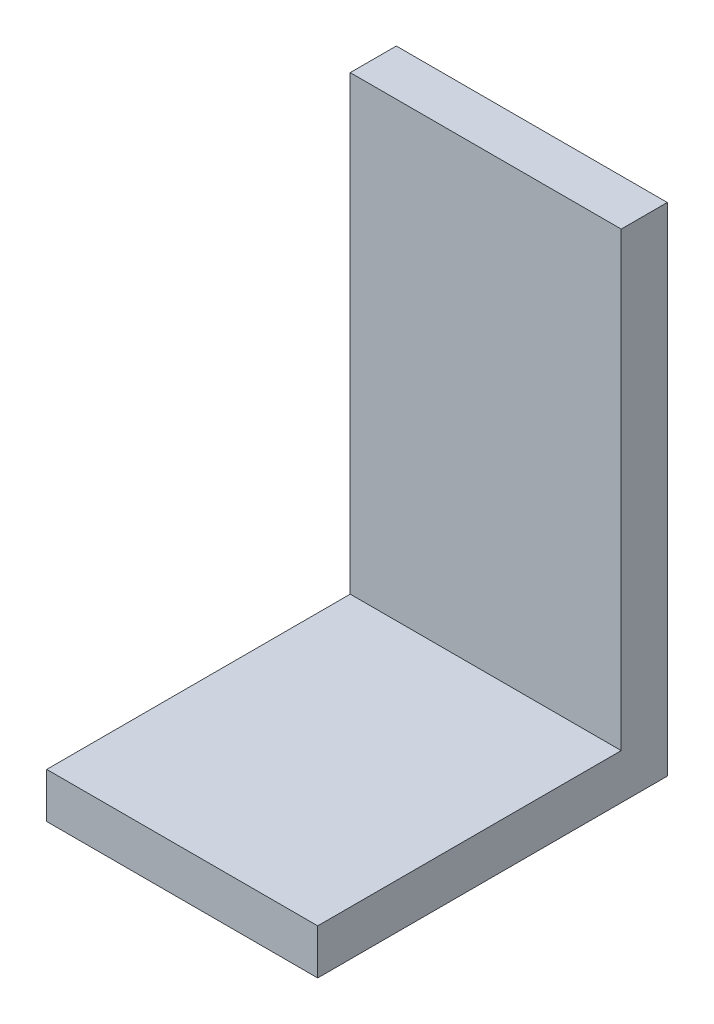
ISO-10303-21;
HEADER;
FILE_DESCRIPTION(('STEP AP214'),'2;1');
FILE_NAME('part.step','',(''),(''),'','','');
FILE_SCHEMA(('AUTOMOTIVE_DESIGN { 1 0 10303 214 1 1 1 1 }'));
ENDSEC;
DATA;
#1=APPLICATION_CONTEXT('core data for automotive mechanical design processes');
#2=APPLICATION_PROTOCOL_DEFINITION('international standard','automotive_design',2000,#1);
#3=PRODUCT_CONTEXT('',#1,'mechanical');
#4=PRODUCT('Part','Part','',(#3));
#5=PRODUCT_RELATED_PRODUCT_CATEGORY('part','',(#4));
#6=PRODUCT_DEFINITION_FORMATION('','',#4);
#7=PRODUCT_DEFINITION_CONTEXT('part definition',#1,'design');
#8=PRODUCT_DEFINITION('design','',#6,#7);
#9=PRODUCT_DEFINITION_SHAPE('','',#8);
#10=(LENGTH_UNIT() NAMED_UNIT(*) SI_UNIT(.MILLI.,.METRE.));
#11=(NAMED_UNIT(*) PLANE_ANGLE_UNIT() SI_UNIT($,.RADIAN.));
#12=(NAMED_UNIT(*) SI_UNIT($,.STERADIAN.) SOLID_ANGLE_UNIT());
#13=UNCERTAINTY_MEASURE_WITH_UNIT(LENGTH_MEASURE(1.E-05),#10,'distance_accuracy_value','');
#14=(GEOMETRIC_REPRESENTATION_CONTEXT(3) GLOBAL_UNCERTAINTY_ASSIGNED_CONTEXT((#13)) GLOBAL_UNIT_ASSIGNED_CONTEXT((#10,
#11,#12)) REPRESENTATION_CONTEXT('',''));
#15=CARTESIAN_POINT('',(0.,0.,0.));
#16=DIRECTION('',(0.,0.,1.));
#17=DIRECTION('',(1.,0.,0.));
#18=AXIS2_PLACEMENT_3D('',#15,#16,#17);
#19=CARTESIAN_POINT('',(-3.1,-4.55,0.));
#20=DIRECTION('',(1.,0.,0.));
#21=DIRECTION('',(0.,0.,1.));
#22=AXIS2_PLACEMENT_3D('',#19,#20,#21);
#23=PLANE('',#22);
#24=DIRECTION('',(0.,-1.,0.));
#25=VECTOR('',#24,1.);
#26=CARTESIAN_POINT('',(-3.1,-4.,0.));
#27=LINE('',#26,#25);
#28=CARTESIAN_POINT('',(-3.1,-4.,0.));
#29=VERTEX_POINT('',#28);
#30=CARTESIAN_POINT('',(-3.1,-4.55,0.));
#31=VERTEX_POINT('',#30);
#32=EDGE_CURVE('E11',#29,#31,#27,.T.);
#33=ORIENTED_EDGE('',*,*,#32,.F.);
#34=DIRECTION('',(0.,0.,-1.));
#35=VECTOR('',#34,1.);
#36=CARTESIAN_POINT('',(-3.1,-4.,0.051));
#37=LINE('',#36,#35);
#38=CARTESIAN_POINT('',(-3.1,-4.,0.051));
#39=VERTEX_POINT('',#38);
#40=EDGE_CURVE('E24',#39,#29,#37,.T.);
#41=ORIENTED_EDGE('',*,*,#40,.F.);
#42=DIRECTION('',(0.,1.,0.));
#43=VECTOR('',#42,1.);
#44=CARTESIAN_POINT('',(-3.1,-4.5,0.051));
#45=LINE('',#44,#43);
#46=CARTESIAN_POINT('',(-3.1,-4.5,0.051));
#47=VERTEX_POINT('',#46);
#48=EDGE_CURVE('E87',#47,#39,#45,.T.);
#49=ORIENTED_EDGE('',*,*,#48,.F.);
#50=DIRECTION('',(0.,0.,-1.));
#51=VECTOR('',#50,1.);
#52=CARTESIAN_POINT('',(-3.1,-4.5,0.387));
#53=LINE('',#52,#51);
#54=CARTESIAN_POINT('',(-3.1,-4.5,0.387));
#55=VERTEX_POINT('',#54);
#56=EDGE_CURVE('E114',#55,#47,#53,.T.);
#57=ORIENTED_EDGE('',*,*,#56,.F.);
#58=DIRECTION('',(0.,1.,0.));
#59=VECTOR('',#58,1.);
#60=CARTESIAN_POINT('',(-3.1,-4.55,0.387));
#61=LINE('',#60,#59);
#62=CARTESIAN_POINT('',(-3.1,-4.55,0.387));
#63=VERTEX_POINT('',#62);
#64=EDGE_CURVE('E111',#63,#55,#61,.T.);
#65=ORIENTED_EDGE('',*,*,#64,.F.);
#66=DIRECTION('',(0.,0.,1.));
#67=VECTOR('',#66,1.);
#68=CARTESIAN_POINT('',(-3.1,-4.55,0.));
#69=LINE('',#68,#67);
#70=EDGE_CURVE('E108',#31,#63,#69,.T.);
#71=ORIENTED_EDGE('',*,*,#70,.F.);
#72=EDGE_LOOP('',(#33,#41,#49,#57,#65,#71));
#73=FACE_BOUND('',#72,.T.);
#74=ADVANCED_FACE('F17',(#73),#23,.T.);
#75=CARTESIAN_POINT('',(-3.4,-4.,0.));
#76=DIRECTION('',(-1.,0.,0.));
#77=DIRECTION('',(0.,0.,1.));
#78=AXIS2_PLACEMENT_3D('',#75,#76,#77);
#79=PLANE('',#78);
#80=DIRECTION('',(0.,1.,0.));
#81=VECTOR('',#80,1.);
#82=CARTESIAN_POINT('',(-3.4,-4.55,0.));
#83=LINE('',#82,#81);
#84=CARTESIAN_POINT('',(-3.4,-4.55,0.));
#85=VERTEX_POINT('',#84);
#86=CARTESIAN_POINT('',(-3.4,-4.,0.));
#87=VERTEX_POINT('',#86);
#88=EDGE_CURVE('E106',#85,#87,#83,.T.);
#89=ORIENTED_EDGE('',*,*,#88,.F.);
#90=DIRECTION('',(0.,0.,-1.));
#91=VECTOR('',#90,1.);
#92=CARTESIAN_POINT('',(-3.4,-4.55,0.387));
#93=LINE('',#92,#91);
#94=CARTESIAN_POINT('',(-3.4,-4.55,0.387));
#95=VERTEX_POINT('',#94);
#96=EDGE_CURVE('E103',#95,#85,#93,.T.);
#97=ORIENTED_EDGE('',*,*,#96,.F.);
#98=DIRECTION('',(0.,-1.,0.));
#99=VECTOR('',#98,1.);
#100=CARTESIAN_POINT('',(-3.4,-4.5,0.387));
#101=LINE('',#100,#99);
#102=CARTESIAN_POINT('',(-3.4,-4.5,0.387));
#103=VERTEX_POINT('',#102);
#104=EDGE_CURVE('E100',#103,#95,#101,.T.);
#105=ORIENTED_EDGE('',*,*,#104,.F.);
#106=DIRECTION('',(0.,0.,1.));
#107=VECTOR('',#106,1.);
#108=CARTESIAN_POINT('',(-3.4,-4.5,0.051));
#109=LINE('',#108,#107);
#110=CARTESIAN_POINT('',(-3.4,-4.5,0.051));
#111=VERTEX_POINT('',#110);
#112=EDGE_CURVE('E72',#111,#103,#109,.T.);
#113=ORIENTED_EDGE('',*,*,#112,.F.);
#114=DIRECTION('',(0.,-1.,0.));
#115=VECTOR('',#114,1.);
#116=CARTESIAN_POINT('',(-3.4,-4.,0.051));
#117=LINE('',#116,#115);
#118=CARTESIAN_POINT('',(-3.4,-4.,0.051));
#119=VERTEX_POINT('',#118);
#120=EDGE_CURVE('E66',#119,#111,#117,.T.);
#121=ORIENTED_EDGE('',*,*,#120,.F.);
#122=DIRECTION('',(0.,0.,1.));
#123=VECTOR('',#122,1.);
#124=CARTESIAN_POINT('',(-3.4,-4.,0.));
#125=LINE('',#124,#123);
#126=EDGE_CURVE('E69',#87,#119,#125,.T.);
#127=ORIENTED_EDGE('',*,*,#126,.F.);
#128=EDGE_LOOP('',(#89,#97,#105,#113,#121,#127));
#129=FACE_BOUND('',#128,.T.);
#130=ADVANCED_FACE('F68',(#129),#79,.T.);
#131=CARTESIAN_POINT('',(-3.1,-4.55,0.387));
#132=DIRECTION('',(0.,0.,1.));
#133=DIRECTION('',(0.,1.,0.));
#134=AXIS2_PLACEMENT_3D('',#131,#132,#133);
#135=PLANE('',#134);
#136=ORIENTED_EDGE('',*,*,#64,.T.);
#137=DIRECTION('',(1.,0.,0.));
#138=VECTOR('',#137,1.);
#139=CARTESIAN_POINT('',(-3.4,-4.5,0.387));
#140=LINE('',#139,#138);
#141=EDGE_CURVE('E83',#103,#55,#140,.T.);
#142=ORIENTED_EDGE('',*,*,#141,.F.);
#143=ORIENTED_EDGE('',*,*,#104,.T.);
#144=DIRECTION('',(-1.,0.,0.));
#145=VECTOR('',#144,1.);
#146=CARTESIAN_POINT('',(-3.1,-4.55,0.387));
#147=LINE('',#146,#145);
#148=EDGE_CURVE('E88',#63,#95,#147,.T.);
#149=ORIENTED_EDGE('',*,*,#148,.F.);
#150=EDGE_LOOP('',(#136,#142,#143,#149));
#151=FACE_BOUND('',#150,.T.);
#152=ADVANCED_FACE('F125',(#151),#135,.T.);
#153=CARTESIAN_POINT('',(-3.1,-4.5,0.051));
#154=DIRECTION('',(0.,0.,1.));
#155=DIRECTION('',(0.,1.,0.));
#156=AXIS2_PLACEMENT_3D('',#153,#154,#155);
#157=PLANE('',#156);
#158=ORIENTED_EDGE('',*,*,#48,.T.);
#159=DIRECTION('',(1.,0.,0.));
#160=VECTOR('',#159,1.);
#161=CARTESIAN_POINT('',(-3.4,-4.,0.051));
#162=LINE('',#161,#160);
#163=EDGE_CURVE('E81',#119,#39,#162,.T.);
#164=ORIENTED_EDGE('',*,*,#163,.F.);
#165=ORIENTED_EDGE('',*,*,#120,.T.);
#166=DIRECTION('',(-1.,0.,0.));
#167=VECTOR('',#166,1.);
#168=CARTESIAN_POINT('',(-3.1,-4.5,0.051));
#169=LINE('',#168,#167);
#170=EDGE_CURVE('E89',#47,#111,#169,.T.);
#171=ORIENTED_EDGE('',*,*,#170,.F.);
#172=EDGE_LOOP('',(#158,#164,#165,#171));
#173=FACE_BOUND('',#172,.T.);
#174=ADVANCED_FACE('F86',(#173),#157,.T.);
#175=CARTESIAN_POINT('',(-3.4,-4.55,0.));
#176=DIRECTION('',(0.,-1.,0.));
#177=DIRECTION('',(0.,0.,1.));
#178=AXIS2_PLACEMENT_3D('',#175,#176,#177);
#179=PLANE('',#178);
#180=DIRECTION('',(-1.,0.,0.));
#181=VECTOR('',#180,1.);
#182=CARTESIAN_POINT('',(-3.1,-4.55,0.));
#183=LINE('',#182,#181);
#184=EDGE_CURVE('E93',#31,#85,#183,.T.);
#185=ORIENTED_EDGE('',*,*,#184,.F.);
#186=ORIENTED_EDGE('',*,*,#70,.T.);
#187=ORIENTED_EDGE('',*,*,#148,.T.);
#188=ORIENTED_EDGE('',*,*,#96,.T.);
#189=EDGE_LOOP('',(#185,#186,#187,#188));
#190=FACE_BOUND('',#189,.T.);
#191=ADVANCED_FACE('F121',(#190),#179,.T.);
#192=CARTESIAN_POINT('',(-3.1,-4.,0.));
#193=DIRECTION('',(0.,1.,0.));
#194=DIRECTION('',(0.,0.,1.));
#195=AXIS2_PLACEMENT_3D('',#192,#193,#194);
#196=PLANE('',#195);
#197=DIRECTION('',(1.,0.,0.));
#198=VECTOR('',#197,1.);
#199=CARTESIAN_POINT('',(-3.4,-4.,0.));
#200=LINE('',#199,#198);
#201=EDGE_CURVE('E82',#87,#29,#200,.T.);
#202=ORIENTED_EDGE('',*,*,#201,.F.);
#203=ORIENTED_EDGE('',*,*,#126,.T.);
#204=ORIENTED_EDGE('',*,*,#163,.T.);
#205=ORIENTED_EDGE('',*,*,#40,.T.);
#206=EDGE_LOOP('',(#202,#203,#204,#205));
#207=FACE_BOUND('',#206,.T.);
#208=ADVANCED_FACE('F80',(#207),#196,.T.);
#209=CARTESIAN_POINT('',(-3.1,-4.5,0.051));
#210=DIRECTION('',(0.,1.,0.));
#211=DIRECTION('',(0.,0.,1.));
#212=AXIS2_PLACEMENT_3D('',#209,#210,#211);
#213=PLANE('',#212);
#214=ORIENTED_EDGE('',*,*,#170,.T.);
#215=ORIENTED_EDGE('',*,*,#112,.T.);
#216=ORIENTED_EDGE('',*,*,#141,.T.);
#217=ORIENTED_EDGE('',*,*,#56,.T.);
#218=EDGE_LOOP('',(#214,#215,#216,#217));
#219=FACE_BOUND('',#218,.T.);
#220=ADVANCED_FACE('F127',(#219),#213,.T.);
#221=CARTESIAN_POINT('',(-3.4,-4.55,0.));
#222=DIRECTION('',(0.,0.,-1.));
#223=DIRECTION('',(0.,1.,0.));
#224=AXIS2_PLACEMENT_3D('',#221,#222,#223);
#225=PLANE('',#224);
#226=ORIENTED_EDGE('',*,*,#88,.T.);
#227=ORIENTED_EDGE('',*,*,#201,.T.);
#228=ORIENTED_EDGE('',*,*,#32,.T.);
#229=ORIENTED_EDGE('',*,*,#184,.T.);
#230=EDGE_LOOP('',(#226,#227,#228,#229));
#231=FACE_BOUND('',#230,.T.);
#232=ADVANCED_FACE('F117',(#231),#225,.T.);
#233=CLOSED_SHELL('',(#74,#130,#152,#174,#191,#208,#220,#232));
#234=MANIFOLD_SOLID_BREP('B1',#233);
#235=ADVANCED_BREP_SHAPE_REPRESENTATION('',(#18,#234),#14);
#236=SHAPE_DEFINITION_REPRESENTATION(#9,#235);
ENDSEC;
END-ISO-10303-21;
